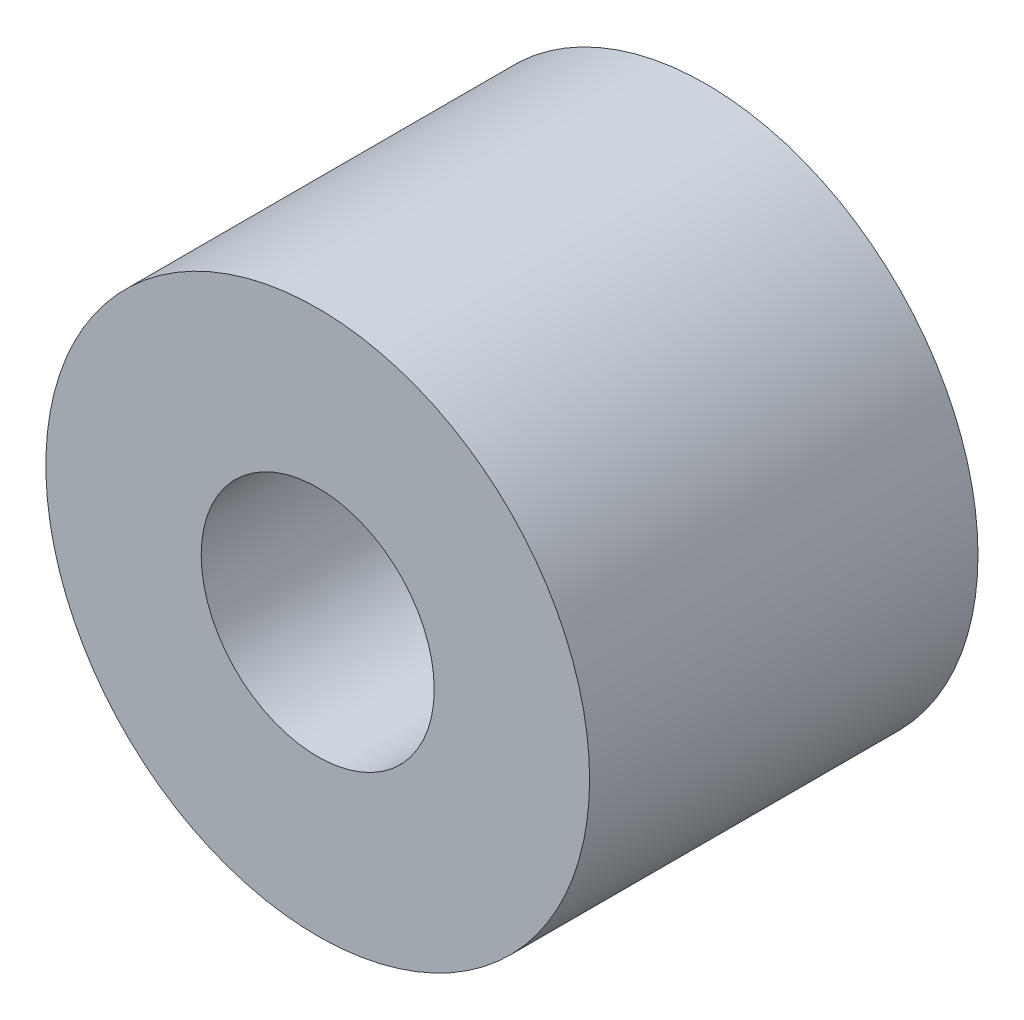
ISO-10303-21;
HEADER;
FILE_DESCRIPTION(('STEP AP214'),'2;1');
FILE_NAME('part.step','',(''),(''),'','','');
FILE_SCHEMA(('AUTOMOTIVE_DESIGN { 1 0 10303 214 1 1 1 1 }'));
ENDSEC;
DATA;
#1=APPLICATION_CONTEXT('core data for automotive mechanical design processes');
#2=APPLICATION_PROTOCOL_DEFINITION('international standard','automotive_design',2000,#1);
#3=PRODUCT_CONTEXT('',#1,'mechanical');
#4=PRODUCT('Part','Part','',(#3));
#5=PRODUCT_RELATED_PRODUCT_CATEGORY('part','',(#4));
#6=PRODUCT_DEFINITION_FORMATION('','',#4);
#7=PRODUCT_DEFINITION_CONTEXT('part definition',#1,'design');
#8=PRODUCT_DEFINITION('design','',#6,#7);
#9=PRODUCT_DEFINITION_SHAPE('','',#8);
#10=(LENGTH_UNIT() NAMED_UNIT(*) SI_UNIT(.MILLI.,.METRE.));
#11=(NAMED_UNIT(*) PLANE_ANGLE_UNIT() SI_UNIT($,.RADIAN.));
#12=(NAMED_UNIT(*) SI_UNIT($,.STERADIAN.) SOLID_ANGLE_UNIT());
#13=UNCERTAINTY_MEASURE_WITH_UNIT(LENGTH_MEASURE(1.E-05),#10,'distance_accuracy_value','');
#14=(GEOMETRIC_REPRESENTATION_CONTEXT(3) GLOBAL_UNCERTAINTY_ASSIGNED_CONTEXT((#13)) GLOBAL_UNIT_ASSIGNED_CONTEXT((#10,
#11,#12)) REPRESENTATION_CONTEXT('',''));
#15=CARTESIAN_POINT('',(0.,0.,0.));
#16=DIRECTION('',(0.,0.,1.));
#17=DIRECTION('',(1.,0.,0.));
#18=AXIS2_PLACEMENT_3D('',#15,#16,#17);
#19=CARTESIAN_POINT('',(-433.06885993322,57.3068090031144,5.));
#20=DIRECTION('',(0.,0.,1.));
#21=DIRECTION('',(1.,0.,0.));
#22=AXIS2_PLACEMENT_3D('',#19,#20,#21);
#23=PLANE('',#22);
#24=CARTESIAN_POINT('',(-433.06885993322,57.3068090031144,5.));
#25=DIRECTION('',(0.,0.,1.));
#26=DIRECTION('',(1.,0.,0.));
#27=AXIS2_PLACEMENT_3D('',#24,#25,#26);
#28=CIRCLE('',#27,3.50000006651561);
#29=CARTESIAN_POINT('',(-429.568859866705,57.3068090031144,5.));
#30=VERTEX_POINT('',#29);
#31=EDGE_CURVE('E10',#30,#30,#28,.T.);
#32=ORIENTED_EDGE('',*,*,#31,.T.);
#33=EDGE_LOOP('',(#32));
#34=FACE_BOUND('',#33,.T.);
#35=CARTESIAN_POINT('',(-433.06885993322,57.3068090031144,5.));
#36=DIRECTION('',(0.,0.,1.));
#37=DIRECTION('',(1.,0.,0.));
#38=AXIS2_PLACEMENT_3D('',#35,#36,#37);
#39=CIRCLE('',#38,1.50000006651561);
#40=CARTESIAN_POINT('',(-431.568859866705,57.3068090031144,5.));
#41=VERTEX_POINT('',#40);
#42=EDGE_CURVE('E42',#41,#41,#39,.T.);
#43=ORIENTED_EDGE('',*,*,#42,.F.);
#44=EDGE_LOOP('',(#43));
#45=FACE_BOUND('',#44,.T.);
#46=ADVANCED_FACE('F31',(#34,#45),#23,.T.);
#47=CARTESIAN_POINT('',(-433.06885993322,57.3068090031144,0.));
#48=DIRECTION('',(0.,0.,1.));
#49=DIRECTION('',(1.,0.,0.));
#50=AXIS2_PLACEMENT_3D('',#47,#48,#49);
#51=PLANE('',#50);
#52=CARTESIAN_POINT('',(-433.06885993322,57.3068090031144,0.));
#53=DIRECTION('',(0.,0.,1.));
#54=DIRECTION('',(1.,0.,0.));
#55=AXIS2_PLACEMENT_3D('',#52,#53,#54);
#56=CIRCLE('',#55,3.50000006651561);
#57=CARTESIAN_POINT('',(-429.568859866705,57.3068090031144,0.));
#58=VERTEX_POINT('',#57);
#59=EDGE_CURVE('E35',#58,#58,#56,.T.);
#60=ORIENTED_EDGE('',*,*,#59,.F.);
#61=EDGE_LOOP('',(#60));
#62=FACE_BOUND('',#61,.T.);
#63=CARTESIAN_POINT('',(-433.06885993322,57.3068090031144,0.));
#64=DIRECTION('',(0.,0.,1.));
#65=DIRECTION('',(1.,0.,0.));
#66=AXIS2_PLACEMENT_3D('',#63,#64,#65);
#67=CIRCLE('',#66,1.50000006651561);
#68=CARTESIAN_POINT('',(-431.568859866705,57.3068090031144,0.));
#69=VERTEX_POINT('',#68);
#70=EDGE_CURVE('E44',#69,#69,#67,.T.);
#71=ORIENTED_EDGE('',*,*,#70,.T.);
#72=EDGE_LOOP('',(#71));
#73=FACE_BOUND('',#72,.T.);
#74=ADVANCED_FACE('F54',(#62,#73),#51,.F.);
#75=CARTESIAN_POINT('',(-433.06885993322,57.3068090031144,5.));
#76=DIRECTION('',(0.,0.,-1.));
#77=DIRECTION('',(-1.,0.,0.));
#78=AXIS2_PLACEMENT_3D('',#75,#76,#77);
#79=CYLINDRICAL_SURFACE('',#78,3.50000006651561);
#80=ORIENTED_EDGE('',*,*,#31,.F.);
#81=EDGE_LOOP('',(#80));
#82=FACE_BOUND('',#81,.T.);
#83=ORIENTED_EDGE('',*,*,#59,.T.);
#84=EDGE_LOOP('',(#83));
#85=FACE_BOUND('',#84,.T.);
#86=ADVANCED_FACE('F33',(#82,#85),#79,.T.);
#87=CARTESIAN_POINT('',(-433.06885993322,57.3068090031144,5.));
#88=DIRECTION('',(0.,0.,-1.));
#89=DIRECTION('',(-1.,0.,0.));
#90=AXIS2_PLACEMENT_3D('',#87,#88,#89);
#91=CYLINDRICAL_SURFACE('',#90,1.50000006651561);
#92=ORIENTED_EDGE('',*,*,#42,.T.);
#93=EDGE_LOOP('',(#92));
#94=FACE_BOUND('',#93,.T.);
#95=ORIENTED_EDGE('',*,*,#70,.F.);
#96=EDGE_LOOP('',(#95));
#97=FACE_BOUND('',#96,.T.);
#98=ADVANCED_FACE('F50',(#94,#97),#91,.F.);
#99=CLOSED_SHELL('',(#46,#74,#86,#98));
#100=MANIFOLD_SOLID_BREP('B2',#99);
#101=ADVANCED_BREP_SHAPE_REPRESENTATION('',(#18,#100),#14);
#102=SHAPE_DEFINITION_REPRESENTATION(#9,#101);
ENDSEC;
END-ISO-10303-21;
